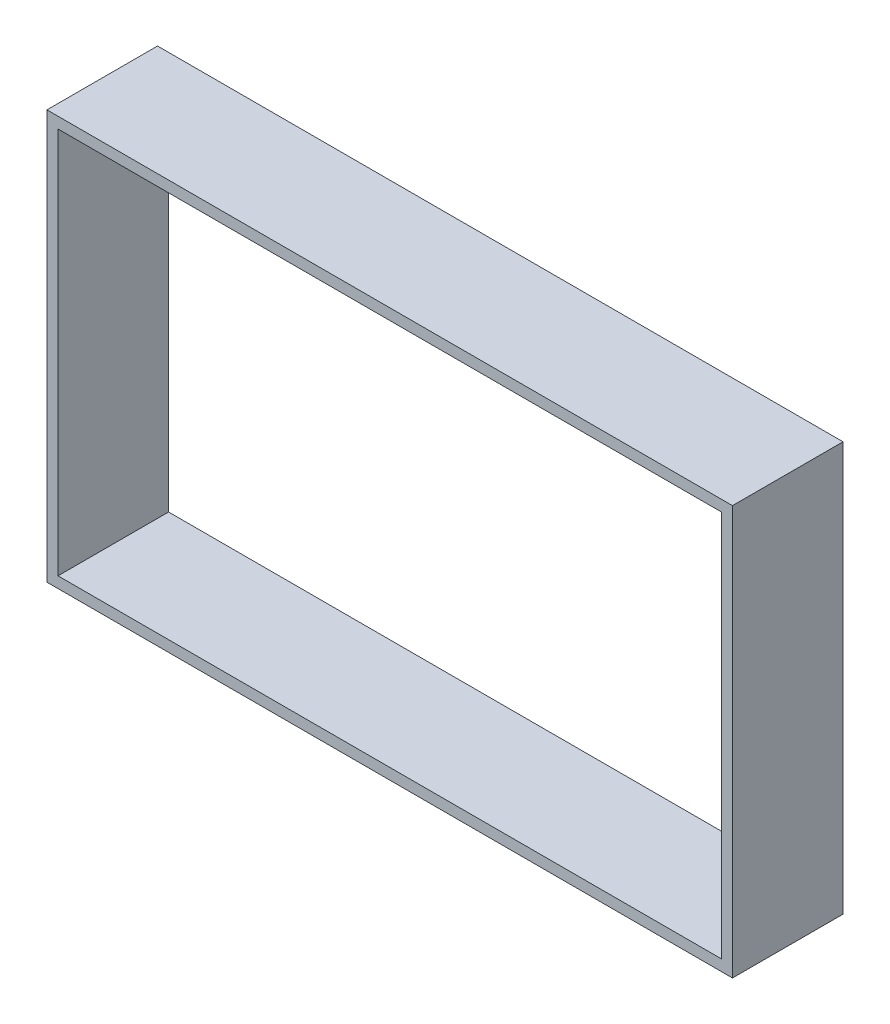
ISO-10303-21;
HEADER;
FILE_DESCRIPTION(('STEP AP214'),'2;1');
FILE_NAME('part.step','',(''),(''),'','','');
FILE_SCHEMA(('AUTOMOTIVE_DESIGN { 1 0 10303 214 1 1 1 1 }'));
ENDSEC;
DATA;
#1=APPLICATION_CONTEXT('core data for automotive mechanical design processes');
#2=APPLICATION_PROTOCOL_DEFINITION('international standard','automotive_design',2000,#1);
#3=PRODUCT_CONTEXT('',#1,'mechanical');
#4=PRODUCT('Part','Part','',(#3));
#5=PRODUCT_RELATED_PRODUCT_CATEGORY('part','',(#4));
#6=PRODUCT_DEFINITION_FORMATION('','',#4);
#7=PRODUCT_DEFINITION_CONTEXT('part definition',#1,'design');
#8=PRODUCT_DEFINITION('design','',#6,#7);
#9=PRODUCT_DEFINITION_SHAPE('','',#8);
#10=(LENGTH_UNIT() NAMED_UNIT(*) SI_UNIT(.MILLI.,.METRE.));
#11=(NAMED_UNIT(*) PLANE_ANGLE_UNIT() SI_UNIT($,.RADIAN.));
#12=(NAMED_UNIT(*) SI_UNIT($,.STERADIAN.) SOLID_ANGLE_UNIT());
#13=UNCERTAINTY_MEASURE_WITH_UNIT(LENGTH_MEASURE(1.E-05),#10,'distance_accuracy_value','');
#14=(GEOMETRIC_REPRESENTATION_CONTEXT(3) GLOBAL_UNCERTAINTY_ASSIGNED_CONTEXT((#13)) GLOBAL_UNIT_ASSIGNED_CONTEXT((#10,
#11,#12)) REPRESENTATION_CONTEXT('',''));
#15=CARTESIAN_POINT('',(0.,0.,0.));
#16=DIRECTION('',(0.,0.,1.));
#17=DIRECTION('',(1.,0.,0.));
#18=AXIS2_PLACEMENT_3D('',#15,#16,#17);
#19=CARTESIAN_POINT('',(0.,0.,10.));
#20=DIRECTION('',(0.,0.,1.));
#21=DIRECTION('',(1.,0.,0.));
#22=AXIS2_PLACEMENT_3D('',#19,#20,#21);
#23=PLANE('',#22);
#24=DIRECTION('',(0.,1.,0.));
#25=VECTOR('',#24,1.);
#26=CARTESIAN_POINT('',(31.,0.,10.));
#27=LINE('',#26,#25);
#28=CARTESIAN_POINT('',(31.,-18.5,10.));
#29=VERTEX_POINT('',#28);
#30=CARTESIAN_POINT('',(31.,18.5,10.));
#31=VERTEX_POINT('',#30);
#32=EDGE_CURVE('E162',#29,#31,#27,.T.);
#33=ORIENTED_EDGE('',*,*,#32,.T.);
#34=DIRECTION('',(-1.,0.,0.));
#35=VECTOR('',#34,1.);
#36=CARTESIAN_POINT('',(0.,18.5,10.));
#37=LINE('',#36,#35);
#38=CARTESIAN_POINT('',(-31.,18.5,10.));
#39=VERTEX_POINT('',#38);
#40=EDGE_CURVE('E165',#31,#39,#37,.T.);
#41=ORIENTED_EDGE('',*,*,#40,.T.);
#42=DIRECTION('',(0.,-1.,0.));
#43=VECTOR('',#42,1.);
#44=CARTESIAN_POINT('',(-31.,0.,10.));
#45=LINE('',#44,#43);
#46=CARTESIAN_POINT('',(-31.,-18.5,10.));
#47=VERTEX_POINT('',#46);
#48=EDGE_CURVE('E168',#39,#47,#45,.T.);
#49=ORIENTED_EDGE('',*,*,#48,.T.);
#50=DIRECTION('',(1.,0.,0.));
#51=VECTOR('',#50,1.);
#52=CARTESIAN_POINT('',(0.,-18.5,10.));
#53=LINE('',#52,#51);
#54=EDGE_CURVE('E170',#47,#29,#53,.T.);
#55=ORIENTED_EDGE('',*,*,#54,.T.);
#56=EDGE_LOOP('',(#33,#41,#49,#55));
#57=FACE_BOUND('',#56,.T.);
#58=DIRECTION('',(-1.,0.,0.));
#59=VECTOR('',#58,1.);
#60=CARTESIAN_POINT('',(-30.,17.5,10.));
#61=LINE('',#60,#59);
#62=CARTESIAN_POINT('',(30.,17.5,10.));
#63=VERTEX_POINT('',#62);
#64=CARTESIAN_POINT('',(-30.,17.5,10.));
#65=VERTEX_POINT('',#64);
#66=EDGE_CURVE('E134',#63,#65,#61,.T.);
#67=ORIENTED_EDGE('',*,*,#66,.F.);
#68=DIRECTION('',(0.,1.,0.));
#69=VECTOR('',#68,1.);
#70=CARTESIAN_POINT('',(30.,-17.5,10.));
#71=LINE('',#70,#69);
#72=CARTESIAN_POINT('',(30.,-17.5,10.));
#73=VERTEX_POINT('',#72);
#74=EDGE_CURVE('E126',#73,#63,#71,.T.);
#75=ORIENTED_EDGE('',*,*,#74,.F.);
#76=DIRECTION('',(1.,0.,0.));
#77=VECTOR('',#76,1.);
#78=CARTESIAN_POINT('',(-30.,-17.5,10.));
#79=LINE('',#78,#77);
#80=CARTESIAN_POINT('',(-30.,-17.5,10.));
#81=VERTEX_POINT('',#80);
#82=EDGE_CURVE('E148',#81,#73,#79,.T.);
#83=ORIENTED_EDGE('',*,*,#82,.F.);
#84=DIRECTION('',(0.,-1.,0.));
#85=VECTOR('',#84,1.);
#86=CARTESIAN_POINT('',(-30.,-17.5,10.));
#87=LINE('',#86,#85);
#88=EDGE_CURVE('E146',#65,#81,#87,.T.);
#89=ORIENTED_EDGE('',*,*,#88,.F.);
#90=EDGE_LOOP('',(#67,#75,#83,#89));
#91=FACE_BOUND('',#90,.T.);
#92=ADVANCED_FACE('F61',(#57,#91),#23,.T.);
#93=CARTESIAN_POINT('',(0.,0.,0.));
#94=DIRECTION('',(0.,0.,1.));
#95=DIRECTION('',(1.,0.,0.));
#96=AXIS2_PLACEMENT_3D('',#93,#94,#95);
#97=PLANE('',#96);
#98=DIRECTION('',(0.,1.,0.));
#99=VECTOR('',#98,1.);
#100=CARTESIAN_POINT('',(31.,0.,0.));
#101=LINE('',#100,#99);
#102=CARTESIAN_POINT('',(31.,-18.5,0.));
#103=VERTEX_POINT('',#102);
#104=CARTESIAN_POINT('',(31.,18.5,0.));
#105=VERTEX_POINT('',#104);
#106=EDGE_CURVE('E142',#103,#105,#101,.T.);
#107=ORIENTED_EDGE('',*,*,#106,.F.);
#108=DIRECTION('',(1.,0.,0.));
#109=VECTOR('',#108,1.);
#110=CARTESIAN_POINT('',(0.,-18.5,0.));
#111=LINE('',#110,#109);
#112=CARTESIAN_POINT('',(-31.,-18.5,0.));
#113=VERTEX_POINT('',#112);
#114=EDGE_CURVE('E166',#113,#103,#111,.T.);
#115=ORIENTED_EDGE('',*,*,#114,.F.);
#116=DIRECTION('',(0.,-1.,0.));
#117=VECTOR('',#116,1.);
#118=CARTESIAN_POINT('',(-31.,0.,0.));
#119=LINE('',#118,#117);
#120=CARTESIAN_POINT('',(-31.,18.5,0.));
#121=VERTEX_POINT('',#120);
#122=EDGE_CURVE('E177',#121,#113,#119,.T.);
#123=ORIENTED_EDGE('',*,*,#122,.F.);
#124=DIRECTION('',(-1.,0.,0.));
#125=VECTOR('',#124,1.);
#126=CARTESIAN_POINT('',(0.,18.5,0.));
#127=LINE('',#126,#125);
#128=EDGE_CURVE('E175',#105,#121,#127,.T.);
#129=ORIENTED_EDGE('',*,*,#128,.F.);
#130=EDGE_LOOP('',(#107,#115,#123,#129));
#131=FACE_BOUND('',#130,.T.);
#132=DIRECTION('',(0.,1.,0.));
#133=VECTOR('',#132,1.);
#134=CARTESIAN_POINT('',(30.,-17.5,0.));
#135=LINE('',#134,#133);
#136=CARTESIAN_POINT('',(30.,-17.5,0.));
#137=VERTEX_POINT('',#136);
#138=CARTESIAN_POINT('',(30.,17.5,0.));
#139=VERTEX_POINT('',#138);
#140=EDGE_CURVE('E84',#137,#139,#135,.T.);
#141=ORIENTED_EDGE('',*,*,#140,.T.);
#142=DIRECTION('',(-1.,0.,0.));
#143=VECTOR('',#142,1.);
#144=CARTESIAN_POINT('',(-30.,17.5,0.));
#145=LINE('',#144,#143);
#146=CARTESIAN_POINT('',(-30.,17.5,0.));
#147=VERTEX_POINT('',#146);
#148=EDGE_CURVE('E141',#139,#147,#145,.T.);
#149=ORIENTED_EDGE('',*,*,#148,.T.);
#150=DIRECTION('',(0.,-1.,0.));
#151=VECTOR('',#150,1.);
#152=CARTESIAN_POINT('',(-30.,-17.5,0.));
#153=LINE('',#152,#151);
#154=CARTESIAN_POINT('',(-30.,-17.5,0.));
#155=VERTEX_POINT('',#154);
#156=EDGE_CURVE('E154',#147,#155,#153,.T.);
#157=ORIENTED_EDGE('',*,*,#156,.T.);
#158=DIRECTION('',(1.,0.,0.));
#159=VECTOR('',#158,1.);
#160=CARTESIAN_POINT('',(-30.,-17.5,0.));
#161=LINE('',#160,#159);
#162=EDGE_CURVE('E135',#155,#137,#161,.T.);
#163=ORIENTED_EDGE('',*,*,#162,.T.);
#164=EDGE_LOOP('',(#141,#149,#157,#163));
#165=FACE_BOUND('',#164,.T.);
#166=ADVANCED_FACE('F195',(#131,#165),#97,.F.);
#167=CARTESIAN_POINT('',(31.,0.,10.));
#168=DIRECTION('',(-1.,0.,0.));
#169=DIRECTION('',(0.,0.,1.));
#170=AXIS2_PLACEMENT_3D('',#167,#168,#169);
#171=PLANE('',#170);
#172=ORIENTED_EDGE('',*,*,#106,.T.);
#173=DIRECTION('',(0.,0.,-1.));
#174=VECTOR('',#173,1.);
#175=CARTESIAN_POINT('',(31.,18.5,10.));
#176=LINE('',#175,#174);
#177=EDGE_CURVE('E12',#31,#105,#176,.T.);
#178=ORIENTED_EDGE('',*,*,#177,.F.);
#179=ORIENTED_EDGE('',*,*,#32,.F.);
#180=DIRECTION('',(0.,0.,-1.));
#181=VECTOR('',#180,1.);
#182=CARTESIAN_POINT('',(31.,-18.5,10.));
#183=LINE('',#182,#181);
#184=EDGE_CURVE('E172',#29,#103,#183,.T.);
#185=ORIENTED_EDGE('',*,*,#184,.T.);
#186=EDGE_LOOP('',(#172,#178,#179,#185));
#187=FACE_BOUND('',#186,.T.);
#188=ADVANCED_FACE('F63',(#187),#171,.F.);
#189=CARTESIAN_POINT('',(0.,18.5,10.));
#190=DIRECTION('',(0.,-1.,0.));
#191=DIRECTION('',(0.,0.,-1.));
#192=AXIS2_PLACEMENT_3D('',#189,#190,#191);
#193=PLANE('',#192);
#194=ORIENTED_EDGE('',*,*,#128,.T.);
#195=DIRECTION('',(0.,0.,-1.));
#196=VECTOR('',#195,1.);
#197=CARTESIAN_POINT('',(-31.,18.5,10.));
#198=LINE('',#197,#196);
#199=EDGE_CURVE('E69',#39,#121,#198,.T.);
#200=ORIENTED_EDGE('',*,*,#199,.F.);
#201=ORIENTED_EDGE('',*,*,#40,.F.);
#202=ORIENTED_EDGE('',*,*,#177,.T.);
#203=EDGE_LOOP('',(#194,#200,#201,#202));
#204=FACE_BOUND('',#203,.T.);
#205=ADVANCED_FACE('F205',(#204),#193,.F.);
#206=CARTESIAN_POINT('',(-31.,0.,10.));
#207=DIRECTION('',(1.,0.,0.));
#208=DIRECTION('',(0.,0.,-1.));
#209=AXIS2_PLACEMENT_3D('',#206,#207,#208);
#210=PLANE('',#209);
#211=ORIENTED_EDGE('',*,*,#122,.T.);
#212=DIRECTION('',(0.,0.,-1.));
#213=VECTOR('',#212,1.);
#214=CARTESIAN_POINT('',(-31.,-18.5,10.));
#215=LINE('',#214,#213);
#216=EDGE_CURVE('E182',#47,#113,#215,.T.);
#217=ORIENTED_EDGE('',*,*,#216,.F.);
#218=ORIENTED_EDGE('',*,*,#48,.F.);
#219=ORIENTED_EDGE('',*,*,#199,.T.);
#220=EDGE_LOOP('',(#211,#217,#218,#219));
#221=FACE_BOUND('',#220,.T.);
#222=ADVANCED_FACE('F189',(#221),#210,.F.);
#223=CARTESIAN_POINT('',(0.,-18.5,10.));
#224=DIRECTION('',(0.,1.,0.));
#225=DIRECTION('',(0.,0.,1.));
#226=AXIS2_PLACEMENT_3D('',#223,#224,#225);
#227=PLANE('',#226);
#228=ORIENTED_EDGE('',*,*,#114,.T.);
#229=ORIENTED_EDGE('',*,*,#184,.F.);
#230=ORIENTED_EDGE('',*,*,#54,.F.);
#231=ORIENTED_EDGE('',*,*,#216,.T.);
#232=EDGE_LOOP('',(#228,#229,#230,#231));
#233=FACE_BOUND('',#232,.T.);
#234=ADVANCED_FACE('F199',(#233),#227,.F.);
#235=CARTESIAN_POINT('',(30.,-17.5,10.));
#236=DIRECTION('',(-1.,0.,0.));
#237=DIRECTION('',(0.,0.,1.));
#238=AXIS2_PLACEMENT_3D('',#235,#236,#237);
#239=PLANE('',#238);
#240=ORIENTED_EDGE('',*,*,#140,.F.);
#241=DIRECTION('',(0.,0.,-1.));
#242=VECTOR('',#241,1.);
#243=CARTESIAN_POINT('',(30.,-17.5,10.));
#244=LINE('',#243,#242);
#245=EDGE_CURVE('E130',#73,#137,#244,.T.);
#246=ORIENTED_EDGE('',*,*,#245,.F.);
#247=ORIENTED_EDGE('',*,*,#74,.T.);
#248=DIRECTION('',(0.,0.,-1.));
#249=VECTOR('',#248,1.);
#250=CARTESIAN_POINT('',(30.,17.5,10.));
#251=LINE('',#250,#249);
#252=EDGE_CURVE('E129',#63,#139,#251,.T.);
#253=ORIENTED_EDGE('',*,*,#252,.T.);
#254=EDGE_LOOP('',(#240,#246,#247,#253));
#255=FACE_BOUND('',#254,.T.);
#256=ADVANCED_FACE('F128',(#255),#239,.T.);
#257=CARTESIAN_POINT('',(-30.,17.5,10.));
#258=DIRECTION('',(0.,-1.,0.));
#259=DIRECTION('',(0.,0.,-1.));
#260=AXIS2_PLACEMENT_3D('',#257,#258,#259);
#261=PLANE('',#260);
#262=ORIENTED_EDGE('',*,*,#148,.F.);
#263=ORIENTED_EDGE('',*,*,#252,.F.);
#264=ORIENTED_EDGE('',*,*,#66,.T.);
#265=DIRECTION('',(0.,0.,-1.));
#266=VECTOR('',#265,1.);
#267=CARTESIAN_POINT('',(-30.,17.5,10.));
#268=LINE('',#267,#266);
#269=EDGE_CURVE('E143',#65,#147,#268,.T.);
#270=ORIENTED_EDGE('',*,*,#269,.T.);
#271=EDGE_LOOP('',(#262,#263,#264,#270));
#272=FACE_BOUND('',#271,.T.);
#273=ADVANCED_FACE('F138',(#272),#261,.T.);
#274=CARTESIAN_POINT('',(-30.,-17.5,10.));
#275=DIRECTION('',(1.,0.,0.));
#276=DIRECTION('',(0.,0.,-1.));
#277=AXIS2_PLACEMENT_3D('',#274,#275,#276);
#278=PLANE('',#277);
#279=ORIENTED_EDGE('',*,*,#156,.F.);
#280=ORIENTED_EDGE('',*,*,#269,.F.);
#281=ORIENTED_EDGE('',*,*,#88,.T.);
#282=DIRECTION('',(0.,0.,-1.));
#283=VECTOR('',#282,1.);
#284=CARTESIAN_POINT('',(-30.,-17.5,10.));
#285=LINE('',#284,#283);
#286=EDGE_CURVE('E76',#81,#155,#285,.T.);
#287=ORIENTED_EDGE('',*,*,#286,.T.);
#288=EDGE_LOOP('',(#279,#280,#281,#287));
#289=FACE_BOUND('',#288,.T.);
#290=ADVANCED_FACE('F228',(#289),#278,.T.);
#291=CARTESIAN_POINT('',(-30.,-17.5,10.));
#292=DIRECTION('',(0.,1.,0.));
#293=DIRECTION('',(0.,0.,1.));
#294=AXIS2_PLACEMENT_3D('',#291,#292,#293);
#295=PLANE('',#294);
#296=ORIENTED_EDGE('',*,*,#162,.F.);
#297=ORIENTED_EDGE('',*,*,#286,.F.);
#298=ORIENTED_EDGE('',*,*,#82,.T.);
#299=ORIENTED_EDGE('',*,*,#245,.T.);
#300=EDGE_LOOP('',(#296,#297,#298,#299));
#301=FACE_BOUND('',#300,.T.);
#302=ADVANCED_FACE('F232',(#301),#295,.T.);
#303=CLOSED_SHELL('',(#92,#166,#188,#205,#222,#234,#256,#273,#290,#302));
#304=MANIFOLD_SOLID_BREP('B2',#303);
#305=ADVANCED_BREP_SHAPE_REPRESENTATION('',(#18,#304),#14);
#306=SHAPE_DEFINITION_REPRESENTATION(#9,#305);
ENDSEC;
END-ISO-10303-21;
